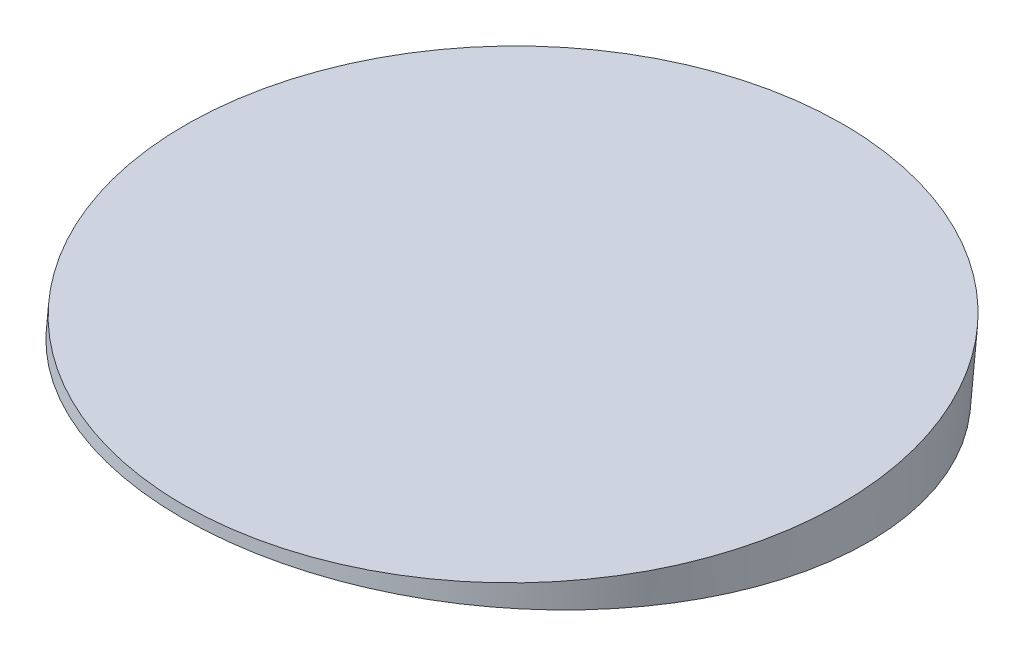
ISO-10303-21;
HEADER;
FILE_DESCRIPTION(('STEP AP214'),'2;1');
FILE_NAME('part.step','',(''),(''),'','','');
FILE_SCHEMA(('AUTOMOTIVE_DESIGN { 1 0 10303 214 1 1 1 1 }'));
ENDSEC;
DATA;
#1=APPLICATION_CONTEXT('core data for automotive mechanical design processes');
#2=APPLICATION_PROTOCOL_DEFINITION('international standard','automotive_design',2000,#1);
#3=PRODUCT_CONTEXT('',#1,'mechanical');
#4=PRODUCT('Part','Part','',(#3));
#5=PRODUCT_RELATED_PRODUCT_CATEGORY('part','',(#4));
#6=PRODUCT_DEFINITION_FORMATION('','',#4);
#7=PRODUCT_DEFINITION_CONTEXT('part definition',#1,'design');
#8=PRODUCT_DEFINITION('design','',#6,#7);
#9=PRODUCT_DEFINITION_SHAPE('','',#8);
#10=(LENGTH_UNIT() NAMED_UNIT(*) SI_UNIT(.MILLI.,.METRE.));
#11=(NAMED_UNIT(*) PLANE_ANGLE_UNIT() SI_UNIT($,.RADIAN.));
#12=(NAMED_UNIT(*) SI_UNIT($,.STERADIAN.) SOLID_ANGLE_UNIT());
#13=UNCERTAINTY_MEASURE_WITH_UNIT(LENGTH_MEASURE(1.E-05),#10,'distance_accuracy_value','');
#14=(GEOMETRIC_REPRESENTATION_CONTEXT(3) GLOBAL_UNCERTAINTY_ASSIGNED_CONTEXT((#13)) GLOBAL_UNIT_ASSIGNED_CONTEXT((#10,
#11,#12)) REPRESENTATION_CONTEXT('',''));
#15=CARTESIAN_POINT('',(0.,0.,0.));
#16=DIRECTION('',(0.,0.,1.));
#17=DIRECTION('',(1.,0.,0.));
#18=AXIS2_PLACEMENT_3D('',#15,#16,#17);
#19=CARTESIAN_POINT('',(-132.804,5416.80825525349,-699.260009999996));
#20=DIRECTION('',(0.,1.,0.));
#21=DIRECTION('',(0.,0.,1.));
#22=AXIS2_PLACEMENT_3D('',#19,#20,#21);
#23=PLANE('',#22);
#24=CARTESIAN_POINT('',(1.17689959097165E-12,5416.80825525349,-699.260009999996));
#25=DIRECTION('',(0.,1.,0.));
#26=DIRECTION('',(1.19814425471696E-12,0.,-1.));
#27=AXIS2_PLACEMENT_3D('',#24,#25,#26);
#28=ELLIPSE('',#27,65.3580381716291,64.9999999999999);
#29=CARTESIAN_POINT('',(7.94852575258809E-11,5416.80825525349,-764.618048171625));
#30=VERTEX_POINT('',#29);
#31=EDGE_CURVE('E19',#30,#30,#28,.F.);
#32=ORIENTED_EDGE('',*,*,#31,.F.);
#33=EDGE_LOOP('',(#32));
#34=FACE_BOUND('',#33,.T.);
#35=ADVANCED_FACE('F15',(#34),#23,.T.);
#36=CARTESIAN_POINT('',(0.,5407.85755819517,-698.319253830586));
#37=DIRECTION('',(1.25240177718638E-13,0.994521895368264,-0.104528463267742));
#38=DIRECTION('',(0.,0.104528463267742,0.994521895368264));
#39=AXIS2_PLACEMENT_3D('',#36,#37,#38);
#40=CYLINDRICAL_SURFACE('',#39,64.9999999999999);
#41=ORIENTED_EDGE('',*,*,#31,.T.);
#42=EDGE_LOOP('',(#41));
#43=FACE_BOUND('',#42,.T.);
#44=CARTESIAN_POINT('',(-4.19220214098229E-13,5407.85755819518,-698.319253830588));
#45=DIRECTION('',(-1.24874531243534E-13,0.994521895368262,-0.104528463267758));
#46=DIRECTION('',(0.,0.104528463267758,0.994521895368262));
#47=AXIS2_PLACEMENT_3D('',#44,#45,#46);
#48=CIRCLE('',#47,65.0000000000001);
#49=CARTESIAN_POINT('',(-4.19220214098229E-13,5414.65190830758,-633.675330631651));
#50=VERTEX_POINT('',#49);
#51=EDGE_CURVE('E10',#50,#50,#48,.F.);
#52=ORIENTED_EDGE('',*,*,#51,.F.);
#53=EDGE_LOOP('',(#52));
#54=FACE_BOUND('',#53,.T.);
#55=ADVANCED_FACE('F28',(#43,#54),#40,.T.);
#56=CARTESIAN_POINT('',(0.,5421.73935623097,-566.242768038099));
#57=DIRECTION('',(0.,-0.994521895368274,0.104528463267651));
#58=DIRECTION('',(0.,-0.104528463267651,-0.994521895368274));
#59=AXIS2_PLACEMENT_3D('',#56,#57,#58);
#60=PLANE('',#59);
#61=ORIENTED_EDGE('',*,*,#51,.T.);
#62=EDGE_LOOP('',(#61));
#63=FACE_BOUND('',#62,.T.);
#64=ADVANCED_FACE('F17',(#63),#60,.T.);
#65=CLOSED_SHELL('',(#35,#55,#64));
#66=MANIFOLD_SOLID_BREP('B1',#65);
#67=ADVANCED_BREP_SHAPE_REPRESENTATION('',(#18,#66),#14);
#68=SHAPE_DEFINITION_REPRESENTATION(#9,#67);
ENDSEC;
END-ISO-10303-21;
